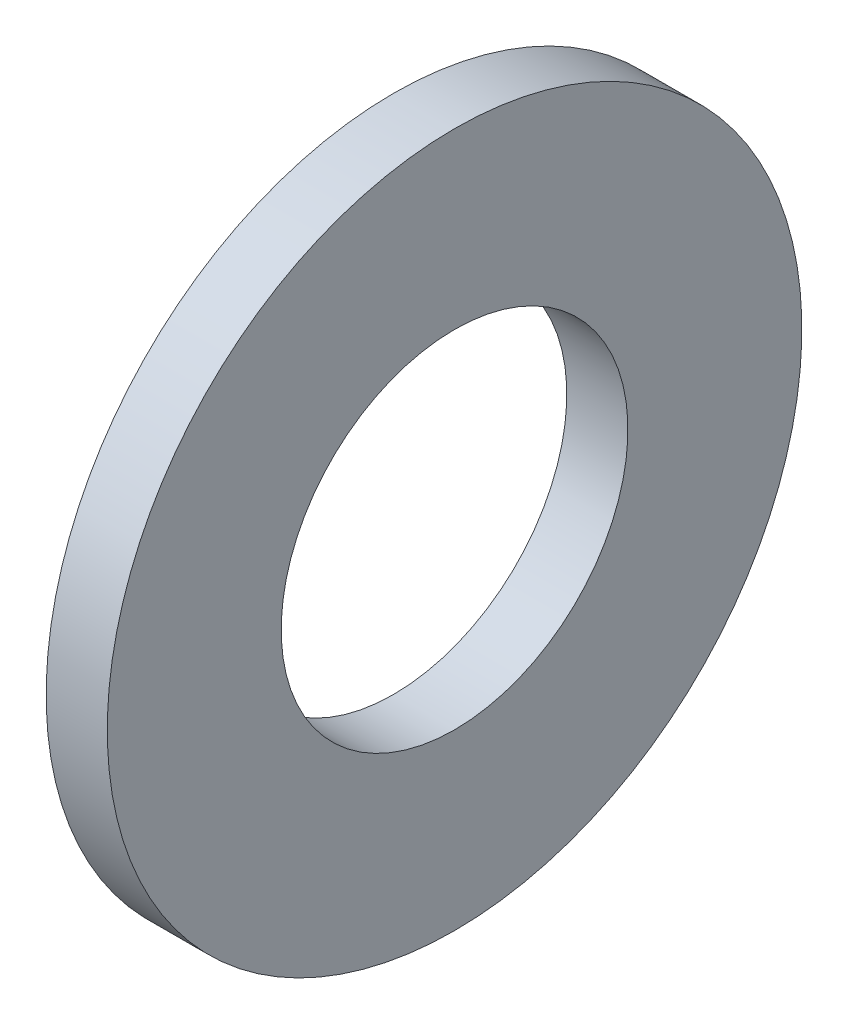
ISO-10303-21;
HEADER;
FILE_DESCRIPTION(('STEP AP214'),'2;1');
FILE_NAME('part.step','',(''),(''),'','','');
FILE_SCHEMA(('AUTOMOTIVE_DESIGN { 1 0 10303 214 1 1 1 1 }'));
ENDSEC;
DATA;
#1=APPLICATION_CONTEXT('core data for automotive mechanical design processes');
#2=APPLICATION_PROTOCOL_DEFINITION('international standard','automotive_design',2000,#1);
#3=PRODUCT_CONTEXT('',#1,'mechanical');
#4=PRODUCT('Part','Part','',(#3));
#5=PRODUCT_RELATED_PRODUCT_CATEGORY('part','',(#4));
#6=PRODUCT_DEFINITION_FORMATION('','',#4);
#7=PRODUCT_DEFINITION_CONTEXT('part definition',#1,'design');
#8=PRODUCT_DEFINITION('design','',#6,#7);
#9=PRODUCT_DEFINITION_SHAPE('','',#8);
#10=(LENGTH_UNIT() NAMED_UNIT(*) SI_UNIT(.MILLI.,.METRE.));
#11=(NAMED_UNIT(*) PLANE_ANGLE_UNIT() SI_UNIT($,.RADIAN.));
#12=(NAMED_UNIT(*) SI_UNIT($,.STERADIAN.) SOLID_ANGLE_UNIT());
#13=UNCERTAINTY_MEASURE_WITH_UNIT(LENGTH_MEASURE(1.E-05),#10,'distance_accuracy_value','');
#14=(GEOMETRIC_REPRESENTATION_CONTEXT(3) GLOBAL_UNCERTAINTY_ASSIGNED_CONTEXT((#13)) GLOBAL_UNIT_ASSIGNED_CONTEXT((#10,
#11,#12)) REPRESENTATION_CONTEXT('',''));
#15=CARTESIAN_POINT('',(0.,0.,0.));
#16=DIRECTION('',(0.,0.,1.));
#17=DIRECTION('',(1.,0.,0.));
#18=AXIS2_PLACEMENT_3D('',#15,#16,#17);
#19=CARTESIAN_POINT('',(0.,3.9624,0.));
#20=DIRECTION('',(-1.,0.,0.));
#21=DIRECTION('',(0.,-1.,0.));
#22=AXIS2_PLACEMENT_3D('',#19,#20,#21);
#23=PLANE('',#22);
#24=CARTESIAN_POINT('',(0.,0.,0.));
#25=DIRECTION('',(-1.,0.,0.));
#26=DIRECTION('',(0.,-1.,0.));
#27=AXIS2_PLACEMENT_3D('',#24,#25,#26);
#28=CIRCLE('',#27,3.9624);
#29=CARTESIAN_POINT('',(0.,-3.96240000000001,0.));
#30=VERTEX_POINT('',#29);
#31=EDGE_CURVE('E18',#30,#30,#28,.T.);
#32=ORIENTED_EDGE('',*,*,#31,.T.);
#33=EDGE_LOOP('',(#32));
#34=FACE_BOUND('',#33,.T.);
#35=CARTESIAN_POINT('',(0.,0.,0.));
#36=DIRECTION('',(-1.,0.,0.));
#37=DIRECTION('',(0.,-1.,0.));
#38=AXIS2_PLACEMENT_3D('',#35,#36,#37);
#39=CIRCLE('',#38,7.9375);
#40=CARTESIAN_POINT('',(0.,-7.93750000000001,0.));
#41=VERTEX_POINT('',#40);
#42=EDGE_CURVE('E27',#41,#41,#39,.T.);
#43=ORIENTED_EDGE('',*,*,#42,.F.);
#44=EDGE_LOOP('',(#43));
#45=FACE_BOUND('',#44,.T.);
#46=ADVANCED_FACE('F15',(#34,#45),#23,.F.);
#47=CARTESIAN_POINT('',(-34.925,0.,0.));
#48=DIRECTION('',(-1.,0.,0.));
#49=DIRECTION('',(0.,-1.,0.));
#50=AXIS2_PLACEMENT_3D('',#47,#48,#49);
#51=CYLINDRICAL_SURFACE('',#50,3.9624);
#52=ORIENTED_EDGE('',*,*,#31,.F.);
#53=EDGE_LOOP('',(#52));
#54=FACE_BOUND('',#53,.T.);
#55=CARTESIAN_POINT('',(-1.39700000000001,0.,0.));
#56=DIRECTION('',(-1.,0.,0.));
#57=DIRECTION('',(0.,-1.,0.));
#58=AXIS2_PLACEMENT_3D('',#55,#56,#57);
#59=CIRCLE('',#58,3.9624);
#60=CARTESIAN_POINT('',(-1.39700000000001,-3.96240000000001,0.));
#61=VERTEX_POINT('',#60);
#62=EDGE_CURVE('E22',#61,#61,#59,.T.);
#63=ORIENTED_EDGE('',*,*,#62,.T.);
#64=EDGE_LOOP('',(#63));
#65=FACE_BOUND('',#64,.T.);
#66=ADVANCED_FACE('F37',(#54,#65),#51,.F.);
#67=CARTESIAN_POINT('',(-34.925,0.,0.));
#68=DIRECTION('',(-1.,0.,0.));
#69=DIRECTION('',(0.,-1.,0.));
#70=AXIS2_PLACEMENT_3D('',#67,#68,#69);
#71=CYLINDRICAL_SURFACE('',#70,7.9375);
#72=CARTESIAN_POINT('',(-1.39700000000001,0.,0.));
#73=DIRECTION('',(-1.,0.,0.));
#74=DIRECTION('',(0.,-1.,0.));
#75=AXIS2_PLACEMENT_3D('',#72,#73,#74);
#76=CIRCLE('',#75,7.9375);
#77=CARTESIAN_POINT('',(-1.39700000000001,-7.93750000000001,0.));
#78=VERTEX_POINT('',#77);
#79=EDGE_CURVE('E10',#78,#78,#76,.F.);
#80=ORIENTED_EDGE('',*,*,#79,.T.);
#81=EDGE_LOOP('',(#80));
#82=FACE_BOUND('',#81,.T.);
#83=ORIENTED_EDGE('',*,*,#42,.T.);
#84=EDGE_LOOP('',(#83));
#85=FACE_BOUND('',#84,.T.);
#86=ADVANCED_FACE('F40',(#82,#85),#71,.T.);
#87=CARTESIAN_POINT('',(-1.397,7.9375,0.));
#88=DIRECTION('',(1.,0.,0.));
#89=DIRECTION('',(0.,1.,0.));
#90=AXIS2_PLACEMENT_3D('',#87,#88,#89);
#91=PLANE('',#90);
#92=ORIENTED_EDGE('',*,*,#79,.F.);
#93=EDGE_LOOP('',(#92));
#94=FACE_BOUND('',#93,.T.);
#95=ORIENTED_EDGE('',*,*,#62,.F.);
#96=EDGE_LOOP('',(#95));
#97=FACE_BOUND('',#96,.T.);
#98=ADVANCED_FACE('F43',(#94,#97),#91,.F.);
#99=CLOSED_SHELL('',(#46,#66,#86,#98));
#100=MANIFOLD_SOLID_BREP('B1',#99);
#101=ADVANCED_BREP_SHAPE_REPRESENTATION('',(#18,#100),#14);
#102=SHAPE_DEFINITION_REPRESENTATION(#9,#101);
ENDSEC;
END-ISO-10303-21;
